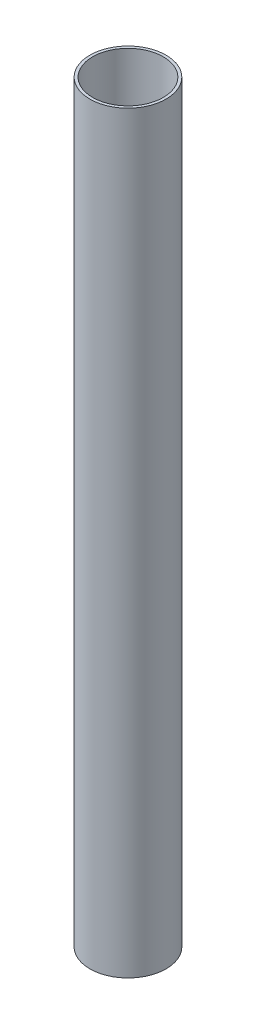
ISO-10303-21;
HEADER;
FILE_DESCRIPTION(('STEP AP214'),'2;1');
FILE_NAME('part.step','',(''),(''),'','','');
FILE_SCHEMA(('AUTOMOTIVE_DESIGN { 1 0 10303 214 1 1 1 1 }'));
ENDSEC;
DATA;
#1=APPLICATION_CONTEXT('core data for automotive mechanical design processes');
#2=APPLICATION_PROTOCOL_DEFINITION('international standard','automotive_design',2000,#1);
#3=PRODUCT_CONTEXT('',#1,'mechanical');
#4=PRODUCT('Part','Part','',(#3));
#5=PRODUCT_RELATED_PRODUCT_CATEGORY('part','',(#4));
#6=PRODUCT_DEFINITION_FORMATION('','',#4);
#7=PRODUCT_DEFINITION_CONTEXT('part definition',#1,'design');
#8=PRODUCT_DEFINITION('design','',#6,#7);
#9=PRODUCT_DEFINITION_SHAPE('','',#8);
#10=(LENGTH_UNIT() NAMED_UNIT(*) SI_UNIT(.MILLI.,.METRE.));
#11=(NAMED_UNIT(*) PLANE_ANGLE_UNIT() SI_UNIT($,.RADIAN.));
#12=(NAMED_UNIT(*) SI_UNIT($,.STERADIAN.) SOLID_ANGLE_UNIT());
#13=UNCERTAINTY_MEASURE_WITH_UNIT(LENGTH_MEASURE(1.E-05),#10,'distance_accuracy_value','');
#14=(GEOMETRIC_REPRESENTATION_CONTEXT(3) GLOBAL_UNCERTAINTY_ASSIGNED_CONTEXT((#13)) GLOBAL_UNIT_ASSIGNED_CONTEXT((#10,
#11,#12)) REPRESENTATION_CONTEXT('',''));
#15=CARTESIAN_POINT('',(0.,0.,0.));
#16=DIRECTION('',(0.,0.,1.));
#17=DIRECTION('',(1.,0.,0.));
#18=AXIS2_PLACEMENT_3D('',#15,#16,#17);
#19=CARTESIAN_POINT('',(0.,812.8,0.));
#20=DIRECTION('',(0.,1.,0.));
#21=DIRECTION('',(0.,0.,1.));
#22=AXIS2_PLACEMENT_3D('',#19,#20,#21);
#23=PLANE('',#22);
#24=CARTESIAN_POINT('',(0.,812.8,0.));
#25=DIRECTION('',(0.,1.,0.));
#26=DIRECTION('',(0.,0.,1.));
#27=AXIS2_PLACEMENT_3D('',#24,#25,#26);
#28=CIRCLE('',#27,41.099994);
#29=CARTESIAN_POINT('',(0.,812.8,41.099994));
#30=VERTEX_POINT('',#29);
#31=EDGE_CURVE('E10',#30,#30,#28,.T.);
#32=ORIENTED_EDGE('',*,*,#31,.T.);
#33=EDGE_LOOP('',(#32));
#34=FACE_BOUND('',#33,.T.);
#35=CARTESIAN_POINT('',(0.,812.8,0.));
#36=DIRECTION('',(0.,1.,0.));
#37=DIRECTION('',(0.,0.,1.));
#38=AXIS2_PLACEMENT_3D('',#35,#36,#37);
#39=CIRCLE('',#38,38.1);
#40=CARTESIAN_POINT('',(0.,812.8,38.1));
#41=VERTEX_POINT('',#40);
#42=EDGE_CURVE('E42',#41,#41,#39,.T.);
#43=ORIENTED_EDGE('',*,*,#42,.F.);
#44=EDGE_LOOP('',(#43));
#45=FACE_BOUND('',#44,.T.);
#46=ADVANCED_FACE('F31',(#34,#45),#23,.T.);
#47=CARTESIAN_POINT('',(0.,0.,0.));
#48=DIRECTION('',(0.,1.,0.));
#49=DIRECTION('',(0.,0.,1.));
#50=AXIS2_PLACEMENT_3D('',#47,#48,#49);
#51=PLANE('',#50);
#52=CARTESIAN_POINT('',(0.,0.,0.));
#53=DIRECTION('',(0.,1.,0.));
#54=DIRECTION('',(0.,0.,1.));
#55=AXIS2_PLACEMENT_3D('',#52,#53,#54);
#56=CIRCLE('',#55,41.099994);
#57=CARTESIAN_POINT('',(0.,0.,41.099994));
#58=VERTEX_POINT('',#57);
#59=EDGE_CURVE('E35',#58,#58,#56,.T.);
#60=ORIENTED_EDGE('',*,*,#59,.F.);
#61=EDGE_LOOP('',(#60));
#62=FACE_BOUND('',#61,.T.);
#63=CARTESIAN_POINT('',(0.,0.,0.));
#64=DIRECTION('',(0.,1.,0.));
#65=DIRECTION('',(0.,0.,1.));
#66=AXIS2_PLACEMENT_3D('',#63,#64,#65);
#67=CIRCLE('',#66,38.1);
#68=CARTESIAN_POINT('',(0.,0.,38.1));
#69=VERTEX_POINT('',#68);
#70=EDGE_CURVE('E44',#69,#69,#67,.T.);
#71=ORIENTED_EDGE('',*,*,#70,.T.);
#72=EDGE_LOOP('',(#71));
#73=FACE_BOUND('',#72,.T.);
#74=ADVANCED_FACE('F54',(#62,#73),#51,.F.);
#75=CARTESIAN_POINT('',(0.,812.8,0.));
#76=DIRECTION('',(0.,-1.,0.));
#77=DIRECTION('',(0.,0.,-1.));
#78=AXIS2_PLACEMENT_3D('',#75,#76,#77);
#79=CYLINDRICAL_SURFACE('',#78,41.099994);
#80=ORIENTED_EDGE('',*,*,#31,.F.);
#81=EDGE_LOOP('',(#80));
#82=FACE_BOUND('',#81,.T.);
#83=ORIENTED_EDGE('',*,*,#59,.T.);
#84=EDGE_LOOP('',(#83));
#85=FACE_BOUND('',#84,.T.);
#86=ADVANCED_FACE('F33',(#82,#85),#79,.T.);
#87=CARTESIAN_POINT('',(0.,812.8,0.));
#88=DIRECTION('',(0.,-1.,0.));
#89=DIRECTION('',(0.,0.,-1.));
#90=AXIS2_PLACEMENT_3D('',#87,#88,#89);
#91=CYLINDRICAL_SURFACE('',#90,38.1);
#92=ORIENTED_EDGE('',*,*,#42,.T.);
#93=EDGE_LOOP('',(#92));
#94=FACE_BOUND('',#93,.T.);
#95=ORIENTED_EDGE('',*,*,#70,.F.);
#96=EDGE_LOOP('',(#95));
#97=FACE_BOUND('',#96,.T.);
#98=ADVANCED_FACE('F50',(#94,#97),#91,.F.);
#99=CLOSED_SHELL('',(#46,#74,#86,#98));
#100=MANIFOLD_SOLID_BREP('B2',#99);
#101=ADVANCED_BREP_SHAPE_REPRESENTATION('',(#18,#100),#14);
#102=SHAPE_DEFINITION_REPRESENTATION(#9,#101);
ENDSEC;
END-ISO-10303-21;
